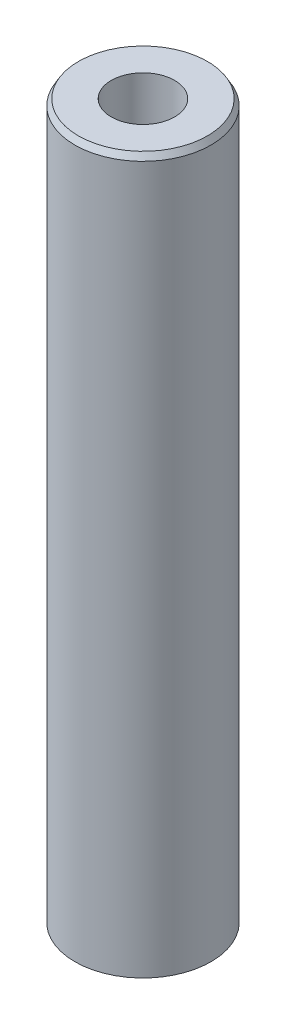
ISO-10303-21;
HEADER;
FILE_DESCRIPTION(('STEP AP214'),'2;1');
FILE_NAME('part.step','',(''),(''),'','','');
FILE_SCHEMA(('AUTOMOTIVE_DESIGN { 1 0 10303 214 1 1 1 1 }'));
ENDSEC;
DATA;
#1=APPLICATION_CONTEXT('core data for automotive mechanical design processes');
#2=APPLICATION_PROTOCOL_DEFINITION('international standard','automotive_design',2000,#1);
#3=PRODUCT_CONTEXT('',#1,'mechanical');
#4=PRODUCT('Part','Part','',(#3));
#5=PRODUCT_RELATED_PRODUCT_CATEGORY('part','',(#4));
#6=PRODUCT_DEFINITION_FORMATION('','',#4);
#7=PRODUCT_DEFINITION_CONTEXT('part definition',#1,'design');
#8=PRODUCT_DEFINITION('design','',#6,#7);
#9=PRODUCT_DEFINITION_SHAPE('','',#8);
#10=(LENGTH_UNIT() NAMED_UNIT(*) SI_UNIT(.MILLI.,.METRE.));
#11=(NAMED_UNIT(*) PLANE_ANGLE_UNIT() SI_UNIT($,.RADIAN.));
#12=(NAMED_UNIT(*) SI_UNIT($,.STERADIAN.) SOLID_ANGLE_UNIT());
#13=UNCERTAINTY_MEASURE_WITH_UNIT(LENGTH_MEASURE(1.E-05),#10,'distance_accuracy_value','');
#14=(GEOMETRIC_REPRESENTATION_CONTEXT(3) GLOBAL_UNCERTAINTY_ASSIGNED_CONTEXT((#13)) GLOBAL_UNIT_ASSIGNED_CONTEXT((#10,
#11,#12)) REPRESENTATION_CONTEXT('',''));
#15=CARTESIAN_POINT('',(0.,0.,0.));
#16=DIRECTION('',(0.,0.,1.));
#17=DIRECTION('',(1.,0.,0.));
#18=AXIS2_PLACEMENT_3D('',#15,#16,#17);
#19=CARTESIAN_POINT('',(0.,105.335694948802,0.));
#20=DIRECTION('',(0.,-1.,0.));
#21=DIRECTION('',(0.,0.,-1.));
#22=AXIS2_PLACEMENT_3D('',#19,#20,#21);
#23=CYLINDRICAL_SURFACE('',#22,10.);
#24=CARTESIAN_POINT('',(0.,104.429366785698,0.));
#25=DIRECTION('',(0.,1.,0.));
#26=DIRECTION('',(0.,0.,1.));
#27=AXIS2_PLACEMENT_3D('',#24,#25,#26);
#28=CIRCLE('',#27,10.);
#29=CARTESIAN_POINT('',(0.,104.429366785698,10.));
#30=VERTEX_POINT('',#29);
#31=EDGE_CURVE('E50',#30,#30,#28,.F.);
#32=ORIENTED_EDGE('',*,*,#31,.T.);
#33=EDGE_LOOP('',(#32));
#34=FACE_BOUND('',#33,.T.);
#35=CARTESIAN_POINT('',(0.,0.523268808942504,0.));
#36=DIRECTION('',(0.,1.,0.));
#37=DIRECTION('',(0.,0.,1.));
#38=AXIS2_PLACEMENT_3D('',#35,#36,#37);
#39=CIRCLE('',#38,10.);
#40=CARTESIAN_POINT('',(0.,0.523268808942504,10.));
#41=VERTEX_POINT('',#40);
#42=EDGE_CURVE('E51',#41,#41,#39,.T.);
#43=ORIENTED_EDGE('',*,*,#42,.T.);
#44=EDGE_LOOP('',(#43));
#45=FACE_BOUND('',#44,.T.);
#46=ADVANCED_FACE('F39',(#34,#45),#23,.T.);
#47=CARTESIAN_POINT('',(0.,105.335694948802,0.));
#48=DIRECTION('',(0.,1.,0.));
#49=DIRECTION('',(0.,0.,1.));
#50=AXIS2_PLACEMENT_3D('',#47,#48,#49);
#51=PLANE('',#50);
#52=CARTESIAN_POINT('',(0.,105.335694948802,0.));
#53=DIRECTION('',(0.,1.,0.));
#54=DIRECTION('',(0.,0.,1.));
#55=AXIS2_PLACEMENT_3D('',#52,#53,#54);
#56=CIRCLE('',#55,9.47673119105751);
#57=CARTESIAN_POINT('',(0.,105.335694948802,9.47673119105751));
#58=VERTEX_POINT('',#57);
#59=EDGE_CURVE('E54',#58,#58,#56,.T.);
#60=ORIENTED_EDGE('',*,*,#59,.T.);
#61=EDGE_LOOP('',(#60));
#62=FACE_BOUND('',#61,.T.);
#63=CARTESIAN_POINT('',(0.,105.335694948802,0.));
#64=DIRECTION('',(0.,1.,0.));
#65=DIRECTION('',(0.,0.,1.));
#66=AXIS2_PLACEMENT_3D('',#63,#64,#65);
#67=CIRCLE('',#66,4.65604989580969);
#68=CARTESIAN_POINT('',(0.,105.335694948802,4.65604989580969));
#69=VERTEX_POINT('',#68);
#70=EDGE_CURVE('E58',#69,#69,#67,.T.);
#71=ORIENTED_EDGE('',*,*,#70,.F.);
#72=EDGE_LOOP('',(#71));
#73=FACE_BOUND('',#72,.T.);
#74=ADVANCED_FACE('F69',(#62,#73),#51,.T.);
#75=CARTESIAN_POINT('',(0.,0.,0.));
#76=DIRECTION('',(0.,1.,0.));
#77=DIRECTION('',(0.,0.,1.));
#78=AXIS2_PLACEMENT_3D('',#75,#76,#77);
#79=PLANE('',#78);
#80=CARTESIAN_POINT('',(0.,0.,0.));
#81=DIRECTION('',(0.,1.,0.));
#82=DIRECTION('',(0.,0.,1.));
#83=AXIS2_PLACEMENT_3D('',#80,#81,#82);
#84=CIRCLE('',#83,9.09367183689554);
#85=CARTESIAN_POINT('',(0.,0.,9.09367183689554));
#86=VERTEX_POINT('',#85);
#87=EDGE_CURVE('E10',#86,#86,#84,.F.);
#88=ORIENTED_EDGE('',*,*,#87,.T.);
#89=EDGE_LOOP('',(#88));
#90=FACE_BOUND('',#89,.T.);
#91=CARTESIAN_POINT('',(0.,0.,0.));
#92=DIRECTION('',(0.,1.,0.));
#93=DIRECTION('',(0.,0.,1.));
#94=AXIS2_PLACEMENT_3D('',#91,#92,#93);
#95=CIRCLE('',#94,4.65604989580969);
#96=CARTESIAN_POINT('',(0.,0.,4.65604989580969));
#97=VERTEX_POINT('',#96);
#98=EDGE_CURVE('E63',#97,#97,#95,.T.);
#99=ORIENTED_EDGE('',*,*,#98,.T.);
#100=EDGE_LOOP('',(#99));
#101=FACE_BOUND('',#100,.T.);
#102=ADVANCED_FACE('F75',(#90,#101),#79,.F.);
#103=CARTESIAN_POINT('',(0.,105.335694948802,0.));
#104=DIRECTION('',(0.,-1.,0.));
#105=DIRECTION('',(0.,0.,-1.));
#106=AXIS2_PLACEMENT_3D('',#103,#104,#105);
#107=CYLINDRICAL_SURFACE('',#106,4.65604989580969);
#108=ORIENTED_EDGE('',*,*,#70,.T.);
#109=EDGE_LOOP('',(#108));
#110=FACE_BOUND('',#109,.T.);
#111=ORIENTED_EDGE('',*,*,#98,.F.);
#112=EDGE_LOOP('',(#111));
#113=FACE_BOUND('',#112,.T.);
#114=ADVANCED_FACE('F70',(#110,#113),#107,.F.);
#115=CARTESIAN_POINT('',(0.,105.335694948802,0.));
#116=DIRECTION('',(0.,-1.,0.));
#117=DIRECTION('',(0.,0.,-1.));
#118=AXIS2_PLACEMENT_3D('',#115,#116,#117);
#119=CONICAL_SURFACE('',#118,9.47673119105751,0.52359877559829);
#120=ORIENTED_EDGE('',*,*,#31,.F.);
#121=EDGE_LOOP('',(#120));
#122=FACE_BOUND('',#121,.T.);
#123=ORIENTED_EDGE('',*,*,#59,.F.);
#124=EDGE_LOOP('',(#123));
#125=FACE_BOUND('',#124,.T.);
#126=ADVANCED_FACE('F81',(#122,#125),#119,.T.);
#127=CARTESIAN_POINT('',(0.,0.523268808942504,0.));
#128=DIRECTION('',(0.,1.,0.));
#129=DIRECTION('',(0.,0.,1.));
#130=AXIS2_PLACEMENT_3D('',#127,#128,#129);
#131=CONICAL_SURFACE('',#130,10.,1.0471975511966);
#132=ORIENTED_EDGE('',*,*,#87,.F.);
#133=EDGE_LOOP('',(#132));
#134=FACE_BOUND('',#133,.T.);
#135=ORIENTED_EDGE('',*,*,#42,.F.);
#136=EDGE_LOOP('',(#135));
#137=FACE_BOUND('',#136,.T.);
#138=ADVANCED_FACE('F45',(#134,#137),#131,.T.);
#139=CLOSED_SHELL('',(#46,#74,#102,#114,#126,#138));
#140=MANIFOLD_SOLID_BREP('B2',#139);
#141=ADVANCED_BREP_SHAPE_REPRESENTATION('',(#18,#140),#14);
#142=SHAPE_DEFINITION_REPRESENTATION(#9,#141);
ENDSEC;
END-ISO-10303-21;
